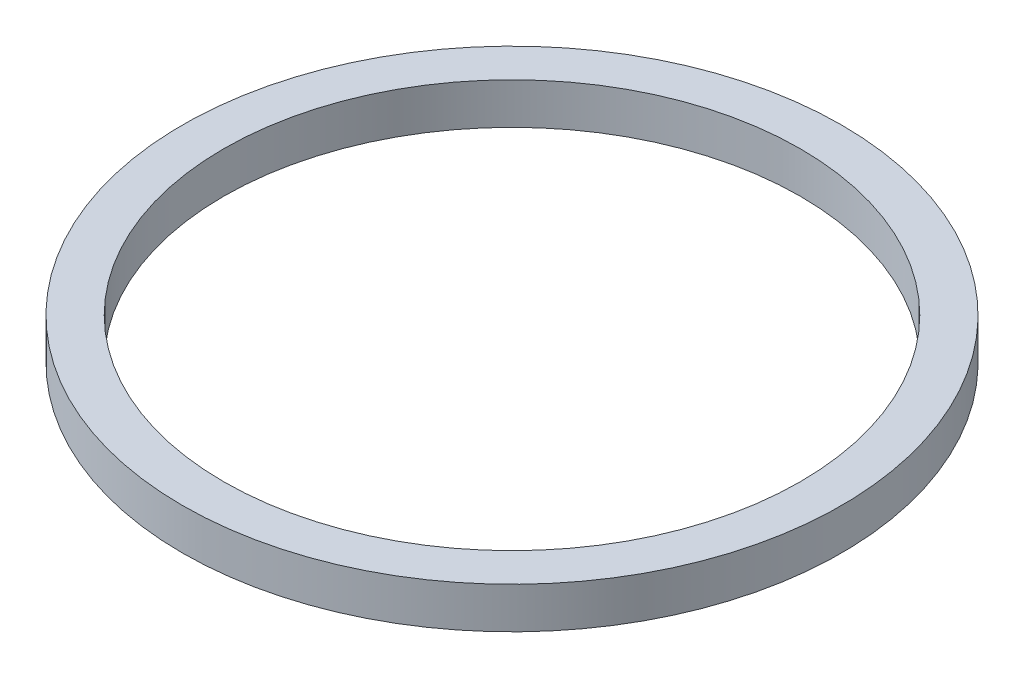
ISO-10303-21;
HEADER;
FILE_DESCRIPTION(('STEP AP214'),'2;1');
FILE_NAME('part.step','',(''),(''),'','','');
FILE_SCHEMA(('AUTOMOTIVE_DESIGN { 1 0 10303 214 1 1 1 1 }'));
ENDSEC;
DATA;
#1=APPLICATION_CONTEXT('core data for automotive mechanical design processes');
#2=APPLICATION_PROTOCOL_DEFINITION('international standard','automotive_design',2000,#1);
#3=PRODUCT_CONTEXT('',#1,'mechanical');
#4=PRODUCT('Part','Part','',(#3));
#5=PRODUCT_RELATED_PRODUCT_CATEGORY('part','',(#4));
#6=PRODUCT_DEFINITION_FORMATION('','',#4);
#7=PRODUCT_DEFINITION_CONTEXT('part definition',#1,'design');
#8=PRODUCT_DEFINITION('design','',#6,#7);
#9=PRODUCT_DEFINITION_SHAPE('','',#8);
#10=(LENGTH_UNIT() NAMED_UNIT(*) SI_UNIT(.MILLI.,.METRE.));
#11=(NAMED_UNIT(*) PLANE_ANGLE_UNIT() SI_UNIT($,.RADIAN.));
#12=(NAMED_UNIT(*) SI_UNIT($,.STERADIAN.) SOLID_ANGLE_UNIT());
#13=UNCERTAINTY_MEASURE_WITH_UNIT(LENGTH_MEASURE(1.E-05),#10,'distance_accuracy_value','');
#14=(GEOMETRIC_REPRESENTATION_CONTEXT(3) GLOBAL_UNCERTAINTY_ASSIGNED_CONTEXT((#13)) GLOBAL_UNIT_ASSIGNED_CONTEXT((#10,
#11,#12)) REPRESENTATION_CONTEXT('',''));
#15=CARTESIAN_POINT('',(0.,0.,0.));
#16=DIRECTION('',(0.,0.,1.));
#17=DIRECTION('',(1.,0.,0.));
#18=AXIS2_PLACEMENT_3D('',#15,#16,#17);
#19=CARTESIAN_POINT('',(0.,5.,0.));
#20=DIRECTION('',(0.,1.,0.));
#21=DIRECTION('',(0.,0.,1.));
#22=AXIS2_PLACEMENT_3D('',#19,#20,#21);
#23=PLANE('',#22);
#24=CARTESIAN_POINT('',(0.,5.,0.));
#25=DIRECTION('',(0.,1.,0.));
#26=DIRECTION('',(0.,0.,1.));
#27=AXIS2_PLACEMENT_3D('',#24,#25,#26);
#28=CIRCLE('',#27,40.);
#29=CARTESIAN_POINT('',(0.,5.,40.));
#30=VERTEX_POINT('',#29);
#31=EDGE_CURVE('E10',#30,#30,#28,.T.);
#32=ORIENTED_EDGE('',*,*,#31,.T.);
#33=EDGE_LOOP('',(#32));
#34=FACE_BOUND('',#33,.T.);
#35=CARTESIAN_POINT('',(0.,5.,0.));
#36=DIRECTION('',(0.,1.,0.));
#37=DIRECTION('',(0.,0.,1.));
#38=AXIS2_PLACEMENT_3D('',#35,#36,#37);
#39=CIRCLE('',#38,35.);
#40=CARTESIAN_POINT('',(0.,5.,35.));
#41=VERTEX_POINT('',#40);
#42=EDGE_CURVE('E42',#41,#41,#39,.T.);
#43=ORIENTED_EDGE('',*,*,#42,.F.);
#44=EDGE_LOOP('',(#43));
#45=FACE_BOUND('',#44,.T.);
#46=ADVANCED_FACE('F31',(#34,#45),#23,.T.);
#47=CARTESIAN_POINT('',(0.,0.,0.));
#48=DIRECTION('',(0.,1.,0.));
#49=DIRECTION('',(0.,0.,1.));
#50=AXIS2_PLACEMENT_3D('',#47,#48,#49);
#51=PLANE('',#50);
#52=CARTESIAN_POINT('',(0.,0.,0.));
#53=DIRECTION('',(0.,1.,0.));
#54=DIRECTION('',(0.,0.,1.));
#55=AXIS2_PLACEMENT_3D('',#52,#53,#54);
#56=CIRCLE('',#55,40.);
#57=CARTESIAN_POINT('',(0.,0.,40.));
#58=VERTEX_POINT('',#57);
#59=EDGE_CURVE('E35',#58,#58,#56,.T.);
#60=ORIENTED_EDGE('',*,*,#59,.F.);
#61=EDGE_LOOP('',(#60));
#62=FACE_BOUND('',#61,.T.);
#63=CARTESIAN_POINT('',(0.,0.,0.));
#64=DIRECTION('',(0.,1.,0.));
#65=DIRECTION('',(0.,0.,1.));
#66=AXIS2_PLACEMENT_3D('',#63,#64,#65);
#67=CIRCLE('',#66,35.);
#68=CARTESIAN_POINT('',(0.,0.,35.));
#69=VERTEX_POINT('',#68);
#70=EDGE_CURVE('E44',#69,#69,#67,.T.);
#71=ORIENTED_EDGE('',*,*,#70,.T.);
#72=EDGE_LOOP('',(#71));
#73=FACE_BOUND('',#72,.T.);
#74=ADVANCED_FACE('F54',(#62,#73),#51,.F.);
#75=CARTESIAN_POINT('',(0.,5.,0.));
#76=DIRECTION('',(0.,-1.,0.));
#77=DIRECTION('',(0.,0.,-1.));
#78=AXIS2_PLACEMENT_3D('',#75,#76,#77);
#79=CYLINDRICAL_SURFACE('',#78,40.);
#80=ORIENTED_EDGE('',*,*,#31,.F.);
#81=EDGE_LOOP('',(#80));
#82=FACE_BOUND('',#81,.T.);
#83=ORIENTED_EDGE('',*,*,#59,.T.);
#84=EDGE_LOOP('',(#83));
#85=FACE_BOUND('',#84,.T.);
#86=ADVANCED_FACE('F33',(#82,#85),#79,.T.);
#87=CARTESIAN_POINT('',(0.,5.,0.));
#88=DIRECTION('',(0.,-1.,0.));
#89=DIRECTION('',(0.,0.,-1.));
#90=AXIS2_PLACEMENT_3D('',#87,#88,#89);
#91=CYLINDRICAL_SURFACE('',#90,35.);
#92=ORIENTED_EDGE('',*,*,#42,.T.);
#93=EDGE_LOOP('',(#92));
#94=FACE_BOUND('',#93,.T.);
#95=ORIENTED_EDGE('',*,*,#70,.F.);
#96=EDGE_LOOP('',(#95));
#97=FACE_BOUND('',#96,.T.);
#98=ADVANCED_FACE('F50',(#94,#97),#91,.F.);
#99=CLOSED_SHELL('',(#46,#74,#86,#98));
#100=MANIFOLD_SOLID_BREP('B2',#99);
#101=ADVANCED_BREP_SHAPE_REPRESENTATION('',(#18,#100),#14);
#102=SHAPE_DEFINITION_REPRESENTATION(#9,#101);
ENDSEC;
END-ISO-10303-21;
